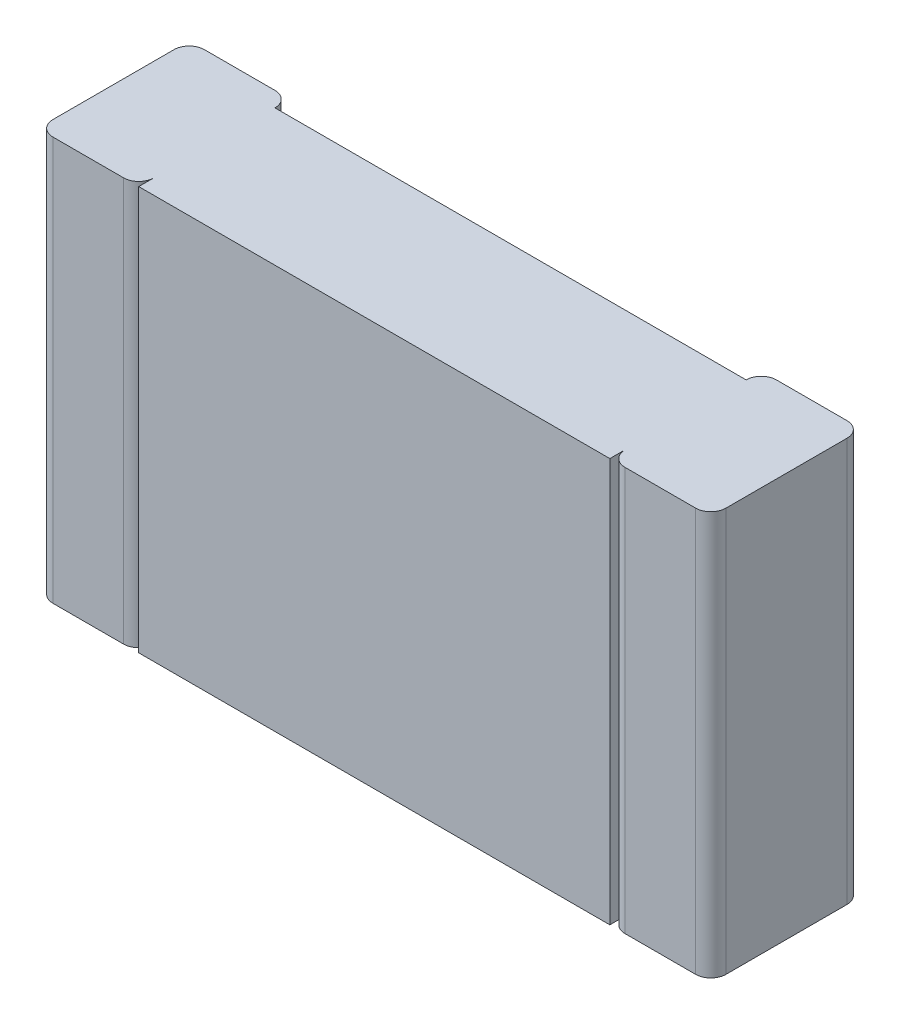
ISO-10303-21;
HEADER;
FILE_DESCRIPTION(('STEP AP214'),'2;1');
FILE_NAME('part.step','',(''),(''),'','','');
FILE_SCHEMA(('AUTOMOTIVE_DESIGN { 1 0 10303 214 1 1 1 1 }'));
ENDSEC;
DATA;
#1=APPLICATION_CONTEXT('core data for automotive mechanical design processes');
#2=APPLICATION_PROTOCOL_DEFINITION('international standard','automotive_design',2000,#1);
#3=PRODUCT_CONTEXT('',#1,'mechanical');
#4=PRODUCT('Part','Part','',(#3));
#5=PRODUCT_RELATED_PRODUCT_CATEGORY('part','',(#4));
#6=PRODUCT_DEFINITION_FORMATION('','',#4);
#7=PRODUCT_DEFINITION_CONTEXT('part definition',#1,'design');
#8=PRODUCT_DEFINITION('design','',#6,#7);
#9=PRODUCT_DEFINITION_SHAPE('','',#8);
#10=(LENGTH_UNIT() NAMED_UNIT(*) SI_UNIT(.MILLI.,.METRE.));
#11=(NAMED_UNIT(*) PLANE_ANGLE_UNIT() SI_UNIT($,.RADIAN.));
#12=(NAMED_UNIT(*) SI_UNIT($,.STERADIAN.) SOLID_ANGLE_UNIT());
#13=UNCERTAINTY_MEASURE_WITH_UNIT(LENGTH_MEASURE(1.E-05),#10,'distance_accuracy_value','');
#14=(GEOMETRIC_REPRESENTATION_CONTEXT(3) GLOBAL_UNCERTAINTY_ASSIGNED_CONTEXT((#13)) GLOBAL_UNIT_ASSIGNED_CONTEXT((#10,
#11,#12)) REPRESENTATION_CONTEXT('',''));
#15=CARTESIAN_POINT('',(0.,0.,0.));
#16=DIRECTION('',(0.,0.,1.));
#17=DIRECTION('',(1.,0.,0.));
#18=AXIS2_PLACEMENT_3D('',#15,#16,#17);
#19=CARTESIAN_POINT('',(-0.955,-0.6,0.045));
#20=DIRECTION('',(0.,1.,0.));
#21=DIRECTION('',(0.,0.,1.));
#22=AXIS2_PLACEMENT_3D('',#19,#20,#21);
#23=CYLINDRICAL_SURFACE('',#22,0.045);
#24=DIRECTION('',(0.,1.,0.));
#25=VECTOR('',#24,1.);
#26=CARTESIAN_POINT('',(-0.955,-0.6,0.));
#27=LINE('',#26,#25);
#28=CARTESIAN_POINT('',(-0.955,0.6,0.));
#29=VERTEX_POINT('',#28);
#30=CARTESIAN_POINT('',(-0.955,-0.6,0.));
#31=VERTEX_POINT('',#30);
#32=EDGE_CURVE('E129',#29,#31,#27,.F.);
#33=ORIENTED_EDGE('',*,*,#32,.T.);
#34=CARTESIAN_POINT('',(-0.955,-0.6,0.045));
#35=DIRECTION('',(0.,1.,0.));
#36=DIRECTION('',(0.,0.,1.));
#37=AXIS2_PLACEMENT_3D('',#34,#35,#36);
#38=CIRCLE('',#37,0.045);
#39=CARTESIAN_POINT('',(-1.,-0.6,0.045));
#40=VERTEX_POINT('',#39);
#41=EDGE_CURVE('E20',#31,#40,#38,.T.);
#42=ORIENTED_EDGE('',*,*,#41,.T.);
#43=DIRECTION('',(0.,1.,0.));
#44=VECTOR('',#43,1.);
#45=CARTESIAN_POINT('',(-1.,-0.6,0.045));
#46=LINE('',#45,#44);
#47=CARTESIAN_POINT('',(-1.,0.6,0.045));
#48=VERTEX_POINT('',#47);
#49=EDGE_CURVE('E136',#40,#48,#46,.T.);
#50=ORIENTED_EDGE('',*,*,#49,.T.);
#51=CARTESIAN_POINT('',(-0.955,0.6,0.045));
#52=DIRECTION('',(0.,1.,0.));
#53=DIRECTION('',(0.,0.,1.));
#54=AXIS2_PLACEMENT_3D('',#51,#52,#53);
#55=CIRCLE('',#54,0.045);
#56=EDGE_CURVE('E232',#29,#48,#55,.T.);
#57=ORIENTED_EDGE('',*,*,#56,.F.);
#58=EDGE_LOOP('',(#33,#42,#50,#57));
#59=FACE_BOUND('',#58,.T.);
#60=ADVANCED_FACE('F17',(#59),#23,.T.);
#61=CARTESIAN_POINT('',(-1.,-0.6,0.));
#62=DIRECTION('',(1.,0.,0.));
#63=DIRECTION('',(0.,0.,-1.));
#64=AXIS2_PLACEMENT_3D('',#61,#62,#63);
#65=PLANE('',#64);
#66=DIRECTION('',(0.,0.,1.));
#67=VECTOR('',#66,1.);
#68=CARTESIAN_POINT('',(-1.,0.6,0.));
#69=LINE('',#68,#67);
#70=CARTESIAN_POINT('',(-1.,0.6,0.405));
#71=VERTEX_POINT('',#70);
#72=EDGE_CURVE('E141',#48,#71,#69,.T.);
#73=ORIENTED_EDGE('',*,*,#72,.F.);
#74=ORIENTED_EDGE('',*,*,#49,.F.);
#75=DIRECTION('',(0.,0.,1.));
#76=VECTOR('',#75,1.);
#77=CARTESIAN_POINT('',(-1.,-0.6,0.));
#78=LINE('',#77,#76);
#79=CARTESIAN_POINT('',(-1.,-0.6,0.405));
#80=VERTEX_POINT('',#79);
#81=EDGE_CURVE('E140',#40,#80,#78,.T.);
#82=ORIENTED_EDGE('',*,*,#81,.T.);
#83=DIRECTION('',(0.,1.,0.));
#84=VECTOR('',#83,1.);
#85=CARTESIAN_POINT('',(-1.,-0.6,0.405));
#86=LINE('',#85,#84);
#87=EDGE_CURVE('E142',#71,#80,#86,.F.);
#88=ORIENTED_EDGE('',*,*,#87,.F.);
#89=EDGE_LOOP('',(#73,#74,#82,#88));
#90=FACE_BOUND('',#89,.T.);
#91=ADVANCED_FACE('F138',(#90),#65,.F.);
#92=CARTESIAN_POINT('',(-0.955,-0.6,0.405));
#93=DIRECTION('',(0.,1.,0.));
#94=DIRECTION('',(0.,0.,1.));
#95=AXIS2_PLACEMENT_3D('',#92,#93,#94);
#96=CYLINDRICAL_SURFACE('',#95,0.045);
#97=CARTESIAN_POINT('',(-0.955,0.6,0.405));
#98=DIRECTION('',(0.,1.,0.));
#99=DIRECTION('',(0.,0.,1.));
#100=AXIS2_PLACEMENT_3D('',#97,#98,#99);
#101=CIRCLE('',#100,0.045);
#102=CARTESIAN_POINT('',(-0.955,0.6,0.45));
#103=VERTEX_POINT('',#102);
#104=EDGE_CURVE('E230',#71,#103,#101,.T.);
#105=ORIENTED_EDGE('',*,*,#104,.F.);
#106=ORIENTED_EDGE('',*,*,#87,.T.);
#107=CARTESIAN_POINT('',(-0.955,-0.6,0.405));
#108=DIRECTION('',(0.,1.,0.));
#109=DIRECTION('',(0.,0.,1.));
#110=AXIS2_PLACEMENT_3D('',#107,#108,#109);
#111=CIRCLE('',#110,0.045);
#112=CARTESIAN_POINT('',(-0.955,-0.6,0.45));
#113=VERTEX_POINT('',#112);
#114=EDGE_CURVE('E151',#80,#113,#111,.T.);
#115=ORIENTED_EDGE('',*,*,#114,.T.);
#116=DIRECTION('',(0.,1.,0.));
#117=VECTOR('',#116,1.);
#118=CARTESIAN_POINT('',(-0.955,-0.6,0.45));
#119=LINE('',#118,#117);
#120=EDGE_CURVE('E200',#103,#113,#119,.F.);
#121=ORIENTED_EDGE('',*,*,#120,.F.);
#122=EDGE_LOOP('',(#105,#106,#115,#121));
#123=FACE_BOUND('',#122,.T.);
#124=ADVANCED_FACE('F452',(#123),#96,.T.);
#125=CARTESIAN_POINT('',(-1.,-0.6,0.45));
#126=DIRECTION('',(0.,0.,1.));
#127=DIRECTION('',(1.,0.,0.));
#128=AXIS2_PLACEMENT_3D('',#125,#126,#127);
#129=PLANE('',#128);
#130=DIRECTION('',(1.,0.,0.));
#131=VECTOR('',#130,1.);
#132=CARTESIAN_POINT('',(-1.,-0.6,0.45));
#133=LINE('',#132,#131);
#134=CARTESIAN_POINT('',(-0.745,-0.6,0.45));
#135=VERTEX_POINT('',#134);
#136=EDGE_CURVE('E248',#113,#135,#133,.T.);
#137=ORIENTED_EDGE('',*,*,#136,.T.);
#138=DIRECTION('',(0.,1.,0.));
#139=VECTOR('',#138,1.);
#140=CARTESIAN_POINT('',(-0.745,-0.6,0.45));
#141=LINE('',#140,#139);
#142=CARTESIAN_POINT('',(-0.745,0.6,0.45));
#143=VERTEX_POINT('',#142);
#144=EDGE_CURVE('E198',#143,#135,#141,.F.);
#145=ORIENTED_EDGE('',*,*,#144,.F.);
#146=DIRECTION('',(1.,0.,0.));
#147=VECTOR('',#146,1.);
#148=CARTESIAN_POINT('',(-1.,0.6,0.45));
#149=LINE('',#148,#147);
#150=EDGE_CURVE('E229',#103,#143,#149,.T.);
#151=ORIENTED_EDGE('',*,*,#150,.F.);
#152=ORIENTED_EDGE('',*,*,#120,.T.);
#153=EDGE_LOOP('',(#137,#145,#151,#152));
#154=FACE_BOUND('',#153,.T.);
#155=ADVANCED_FACE('F442',(#154),#129,.T.);
#156=CARTESIAN_POINT('',(-0.745,-0.6,0.405));
#157=DIRECTION('',(0.,1.,0.));
#158=DIRECTION('',(0.,0.,1.));
#159=AXIS2_PLACEMENT_3D('',#156,#157,#158);
#160=CYLINDRICAL_SURFACE('',#159,0.045);
#161=ORIENTED_EDGE('',*,*,#144,.T.);
#162=CARTESIAN_POINT('',(-0.745,-0.6,0.405));
#163=DIRECTION('',(0.,1.,0.));
#164=DIRECTION('',(0.,0.,1.));
#165=AXIS2_PLACEMENT_3D('',#162,#163,#164);
#166=CIRCLE('',#165,0.045);
#167=CARTESIAN_POINT('',(-0.7,-0.6,0.405));
#168=VERTEX_POINT('',#167);
#169=EDGE_CURVE('E246',#135,#168,#166,.T.);
#170=ORIENTED_EDGE('',*,*,#169,.T.);
#171=DIRECTION('',(0.,1.,0.));
#172=VECTOR('',#171,1.);
#173=CARTESIAN_POINT('',(-0.7,-0.6,0.405));
#174=LINE('',#173,#172);
#175=CARTESIAN_POINT('',(-0.7,0.6,0.405));
#176=VERTEX_POINT('',#175);
#177=EDGE_CURVE('E193',#168,#176,#174,.T.);
#178=ORIENTED_EDGE('',*,*,#177,.T.);
#179=CARTESIAN_POINT('',(-0.745,0.6,0.405));
#180=DIRECTION('',(0.,1.,0.));
#181=DIRECTION('',(0.,0.,1.));
#182=AXIS2_PLACEMENT_3D('',#179,#180,#181);
#183=CIRCLE('',#182,0.045);
#184=EDGE_CURVE('E227',#143,#176,#183,.T.);
#185=ORIENTED_EDGE('',*,*,#184,.F.);
#186=EDGE_LOOP('',(#161,#170,#178,#185));
#187=FACE_BOUND('',#186,.T.);
#188=ADVANCED_FACE('F430',(#187),#160,.T.);
#189=CARTESIAN_POINT('',(-0.7,-0.6,0.405));
#190=DIRECTION('',(1.,0.,0.));
#191=DIRECTION('',(0.,0.,-1.));
#192=AXIS2_PLACEMENT_3D('',#189,#190,#191);
#193=PLANE('',#192);
#194=DIRECTION('',(0.,0.,1.));
#195=VECTOR('',#194,1.);
#196=CARTESIAN_POINT('',(-0.7,0.6,0.405));
#197=LINE('',#196,#195);
#198=CARTESIAN_POINT('',(-0.7,0.6,0.45));
#199=VERTEX_POINT('',#198);
#200=EDGE_CURVE('E188',#176,#199,#197,.T.);
#201=ORIENTED_EDGE('',*,*,#200,.F.);
#202=ORIENTED_EDGE('',*,*,#177,.F.);
#203=DIRECTION('',(0.,0.,1.));
#204=VECTOR('',#203,1.);
#205=CARTESIAN_POINT('',(-0.7,-0.6,0.405));
#206=LINE('',#205,#204);
#207=CARTESIAN_POINT('',(-0.7,-0.6,0.45));
#208=VERTEX_POINT('',#207);
#209=EDGE_CURVE('E206',#168,#208,#206,.T.);
#210=ORIENTED_EDGE('',*,*,#209,.T.);
#211=DIRECTION('',(0.,1.,0.));
#212=VECTOR('',#211,1.);
#213=CARTESIAN_POINT('',(-0.7,-0.6,0.45));
#214=LINE('',#213,#212);
#215=EDGE_CURVE('E181',#199,#208,#214,.F.);
#216=ORIENTED_EDGE('',*,*,#215,.F.);
#217=EDGE_LOOP('',(#201,#202,#210,#216));
#218=FACE_BOUND('',#217,.T.);
#219=ADVANCED_FACE('F420',(#218),#193,.F.);
#220=CARTESIAN_POINT('',(-0.7,-0.6,0.45));
#221=DIRECTION('',(0.,0.,1.));
#222=DIRECTION('',(1.,0.,0.));
#223=AXIS2_PLACEMENT_3D('',#220,#221,#222);
#224=PLANE('',#223);
#225=DIRECTION('',(0.,1.,0.));
#226=VECTOR('',#225,1.);
#227=CARTESIAN_POINT('',(0.7,-0.6,0.45));
#228=LINE('',#227,#226);
#229=CARTESIAN_POINT('',(0.7,0.6,0.45));
#230=VERTEX_POINT('',#229);
#231=CARTESIAN_POINT('',(0.7,-0.6,0.45));
#232=VERTEX_POINT('',#231);
#233=EDGE_CURVE('E174',#230,#232,#228,.F.);
#234=ORIENTED_EDGE('',*,*,#233,.F.);
#235=DIRECTION('',(1.,0.,0.));
#236=VECTOR('',#235,1.);
#237=CARTESIAN_POINT('',(-0.7,0.6,0.45));
#238=LINE('',#237,#236);
#239=EDGE_CURVE('E184',#199,#230,#238,.T.);
#240=ORIENTED_EDGE('',*,*,#239,.F.);
#241=ORIENTED_EDGE('',*,*,#215,.T.);
#242=DIRECTION('',(1.,0.,0.));
#243=VECTOR('',#242,1.);
#244=CARTESIAN_POINT('',(-0.7,-0.6,0.45));
#245=LINE('',#244,#243);
#246=EDGE_CURVE('E203',#208,#232,#245,.T.);
#247=ORIENTED_EDGE('',*,*,#246,.T.);
#248=EDGE_LOOP('',(#234,#240,#241,#247));
#249=FACE_BOUND('',#248,.T.);
#250=ADVANCED_FACE('F407',(#249),#224,.T.);
#251=CARTESIAN_POINT('',(0.7,-0.6,0.405));
#252=DIRECTION('',(1.,0.,0.));
#253=DIRECTION('',(0.,0.,-1.));
#254=AXIS2_PLACEMENT_3D('',#251,#252,#253);
#255=PLANE('',#254);
#256=DIRECTION('',(0.,0.,1.));
#257=VECTOR('',#256,1.);
#258=CARTESIAN_POINT('',(0.7,0.6,0.405));
#259=LINE('',#258,#257);
#260=CARTESIAN_POINT('',(0.7,0.6,0.405));
#261=VERTEX_POINT('',#260);
#262=EDGE_CURVE('E187',#230,#261,#259,.F.);
#263=ORIENTED_EDGE('',*,*,#262,.F.);
#264=ORIENTED_EDGE('',*,*,#233,.T.);
#265=DIRECTION('',(0.,0.,1.));
#266=VECTOR('',#265,1.);
#267=CARTESIAN_POINT('',(0.7,-0.6,0.405));
#268=LINE('',#267,#266);
#269=CARTESIAN_POINT('',(0.7,-0.6,0.405));
#270=VERTEX_POINT('',#269);
#271=EDGE_CURVE('E178',#232,#270,#268,.F.);
#272=ORIENTED_EDGE('',*,*,#271,.T.);
#273=DIRECTION('',(0.,1.,0.));
#274=VECTOR('',#273,1.);
#275=CARTESIAN_POINT('',(0.7,-0.6,0.405));
#276=LINE('',#275,#274);
#277=EDGE_CURVE('E172',#261,#270,#276,.F.);
#278=ORIENTED_EDGE('',*,*,#277,.F.);
#279=EDGE_LOOP('',(#263,#264,#272,#278));
#280=FACE_BOUND('',#279,.T.);
#281=ADVANCED_FACE('F375',(#280),#255,.T.);
#282=CARTESIAN_POINT('',(0.745,-0.6,0.405));
#283=DIRECTION('',(0.,1.,0.));
#284=DIRECTION('',(0.,0.,1.));
#285=AXIS2_PLACEMENT_3D('',#282,#283,#284);
#286=CYLINDRICAL_SURFACE('',#285,0.045);
#287=CARTESIAN_POINT('',(0.745,0.6,0.405));
#288=DIRECTION('',(0.,1.,0.));
#289=DIRECTION('',(0.,0.,1.));
#290=AXIS2_PLACEMENT_3D('',#287,#288,#289);
#291=CIRCLE('',#290,0.045);
#292=CARTESIAN_POINT('',(0.745,0.6,0.45));
#293=VERTEX_POINT('',#292);
#294=EDGE_CURVE('E224',#261,#293,#291,.T.);
#295=ORIENTED_EDGE('',*,*,#294,.F.);
#296=ORIENTED_EDGE('',*,*,#277,.T.);
#297=CARTESIAN_POINT('',(0.745,-0.6,0.405));
#298=DIRECTION('',(0.,1.,0.));
#299=DIRECTION('',(0.,0.,1.));
#300=AXIS2_PLACEMENT_3D('',#297,#298,#299);
#301=CIRCLE('',#300,0.045);
#302=CARTESIAN_POINT('',(0.745,-0.6,0.45));
#303=VERTEX_POINT('',#302);
#304=EDGE_CURVE('E243',#270,#303,#301,.T.);
#305=ORIENTED_EDGE('',*,*,#304,.T.);
#306=DIRECTION('',(0.,1.,0.));
#307=VECTOR('',#306,1.);
#308=CARTESIAN_POINT('',(0.745,-0.6,0.45));
#309=LINE('',#308,#307);
#310=EDGE_CURVE('E170',#293,#303,#309,.F.);
#311=ORIENTED_EDGE('',*,*,#310,.F.);
#312=EDGE_LOOP('',(#295,#296,#305,#311));
#313=FACE_BOUND('',#312,.T.);
#314=ADVANCED_FACE('F406',(#313),#286,.T.);
#315=CARTESIAN_POINT('',(0.7,-0.6,0.45));
#316=DIRECTION('',(0.,0.,1.));
#317=DIRECTION('',(1.,0.,0.));
#318=AXIS2_PLACEMENT_3D('',#315,#316,#317);
#319=PLANE('',#318);
#320=DIRECTION('',(1.,0.,0.));
#321=VECTOR('',#320,1.);
#322=CARTESIAN_POINT('',(0.7,-0.6,0.45));
#323=LINE('',#322,#321);
#324=CARTESIAN_POINT('',(0.955,-0.6,0.45));
#325=VERTEX_POINT('',#324);
#326=EDGE_CURVE('E242',#303,#325,#323,.T.);
#327=ORIENTED_EDGE('',*,*,#326,.T.);
#328=DIRECTION('',(0.,1.,0.));
#329=VECTOR('',#328,1.);
#330=CARTESIAN_POINT('',(0.955,-0.6,0.45));
#331=LINE('',#330,#329);
#332=CARTESIAN_POINT('',(0.955,0.6,0.45));
#333=VERTEX_POINT('',#332);
#334=EDGE_CURVE('E168',#333,#325,#331,.F.);
#335=ORIENTED_EDGE('',*,*,#334,.F.);
#336=DIRECTION('',(1.,0.,0.));
#337=VECTOR('',#336,1.);
#338=CARTESIAN_POINT('',(0.7,0.6,0.45));
#339=LINE('',#338,#337);
#340=EDGE_CURVE('E223',#293,#333,#339,.T.);
#341=ORIENTED_EDGE('',*,*,#340,.F.);
#342=ORIENTED_EDGE('',*,*,#310,.T.);
#343=EDGE_LOOP('',(#327,#335,#341,#342));
#344=FACE_BOUND('',#343,.T.);
#345=ADVANCED_FACE('F483',(#344),#319,.T.);
#346=CARTESIAN_POINT('',(0.955,-0.6,0.405));
#347=DIRECTION('',(0.,1.,0.));
#348=DIRECTION('',(0.,0.,1.));
#349=AXIS2_PLACEMENT_3D('',#346,#347,#348);
#350=CYLINDRICAL_SURFACE('',#349,0.045);
#351=ORIENTED_EDGE('',*,*,#334,.T.);
#352=CARTESIAN_POINT('',(0.955,-0.6,0.405));
#353=DIRECTION('',(0.,1.,0.));
#354=DIRECTION('',(0.,0.,1.));
#355=AXIS2_PLACEMENT_3D('',#352,#353,#354);
#356=CIRCLE('',#355,0.045);
#357=CARTESIAN_POINT('',(1.,-0.6,0.405));
#358=VERTEX_POINT('',#357);
#359=EDGE_CURVE('E239',#325,#358,#356,.T.);
#360=ORIENTED_EDGE('',*,*,#359,.T.);
#361=DIRECTION('',(0.,1.,0.));
#362=VECTOR('',#361,1.);
#363=CARTESIAN_POINT('',(1.,-0.6,0.405));
#364=LINE('',#363,#362);
#365=CARTESIAN_POINT('',(1.,0.6,0.405));
#366=VERTEX_POINT('',#365);
#367=EDGE_CURVE('E166',#366,#358,#364,.F.);
#368=ORIENTED_EDGE('',*,*,#367,.F.);
#369=CARTESIAN_POINT('',(0.955,0.6,0.405));
#370=DIRECTION('',(0.,1.,0.));
#371=DIRECTION('',(0.,0.,1.));
#372=AXIS2_PLACEMENT_3D('',#369,#370,#371);
#373=CIRCLE('',#372,0.045);
#374=EDGE_CURVE('E221',#333,#366,#373,.T.);
#375=ORIENTED_EDGE('',*,*,#374,.F.);
#376=EDGE_LOOP('',(#351,#360,#368,#375));
#377=FACE_BOUND('',#376,.T.);
#378=ADVANCED_FACE('F487',(#377),#350,.T.);
#379=CARTESIAN_POINT('',(1.,-0.6,0.));
#380=DIRECTION('',(1.,0.,0.));
#381=DIRECTION('',(0.,0.,-1.));
#382=AXIS2_PLACEMENT_3D('',#379,#380,#381);
#383=PLANE('',#382);
#384=DIRECTION('',(0.,0.,1.));
#385=VECTOR('',#384,1.);
#386=CARTESIAN_POINT('',(1.,0.6,0.));
#387=LINE('',#386,#385);
#388=CARTESIAN_POINT('',(1.,0.6,0.045));
#389=VERTEX_POINT('',#388);
#390=EDGE_CURVE('E220',#366,#389,#387,.F.);
#391=ORIENTED_EDGE('',*,*,#390,.F.);
#392=ORIENTED_EDGE('',*,*,#367,.T.);
#393=DIRECTION('',(0.,0.,1.));
#394=VECTOR('',#393,1.);
#395=CARTESIAN_POINT('',(1.,-0.6,0.));
#396=LINE('',#395,#394);
#397=CARTESIAN_POINT('',(1.,-0.6,0.045));
#398=VERTEX_POINT('',#397);
#399=EDGE_CURVE('E238',#358,#398,#396,.F.);
#400=ORIENTED_EDGE('',*,*,#399,.T.);
#401=DIRECTION('',(0.,1.,0.));
#402=VECTOR('',#401,1.);
#403=CARTESIAN_POINT('',(1.,-0.6,0.045));
#404=LINE('',#403,#402);
#405=EDGE_CURVE('E157',#389,#398,#404,.F.);
#406=ORIENTED_EDGE('',*,*,#405,.F.);
#407=EDGE_LOOP('',(#391,#392,#400,#406));
#408=FACE_BOUND('',#407,.T.);
#409=ADVANCED_FACE('F298',(#408),#383,.T.);
#410=CARTESIAN_POINT('',(0.955,-0.6,0.045));
#411=DIRECTION('',(0.,1.,0.));
#412=DIRECTION('',(0.,0.,1.));
#413=AXIS2_PLACEMENT_3D('',#410,#411,#412);
#414=CYLINDRICAL_SURFACE('',#413,0.045);
#415=CARTESIAN_POINT('',(0.955,0.6,0.045));
#416=DIRECTION('',(0.,1.,0.));
#417=DIRECTION('',(0.,0.,1.));
#418=AXIS2_PLACEMENT_3D('',#415,#416,#417);
#419=CIRCLE('',#418,0.045);
#420=CARTESIAN_POINT('',(0.955,0.6,0.));
#421=VERTEX_POINT('',#420);
#422=EDGE_CURVE('E217',#389,#421,#419,.T.);
#423=ORIENTED_EDGE('',*,*,#422,.F.);
#424=ORIENTED_EDGE('',*,*,#405,.T.);
#425=CARTESIAN_POINT('',(0.955,-0.6,0.045));
#426=DIRECTION('',(0.,1.,0.));
#427=DIRECTION('',(0.,0.,1.));
#428=AXIS2_PLACEMENT_3D('',#425,#426,#427);
#429=CIRCLE('',#428,0.045);
#430=CARTESIAN_POINT('',(0.955,-0.6,0.));
#431=VERTEX_POINT('',#430);
#432=EDGE_CURVE('E235',#398,#431,#429,.T.);
#433=ORIENTED_EDGE('',*,*,#432,.T.);
#434=DIRECTION('',(0.,1.,0.));
#435=VECTOR('',#434,1.);
#436=CARTESIAN_POINT('',(0.955,-0.6,0.));
#437=LINE('',#436,#435);
#438=EDGE_CURVE('E175',#431,#421,#437,.T.);
#439=ORIENTED_EDGE('',*,*,#438,.T.);
#440=EDGE_LOOP('',(#423,#424,#433,#439));
#441=FACE_BOUND('',#440,.T.);
#442=ADVANCED_FACE('F302',(#441),#414,.T.);
#443=CARTESIAN_POINT('',(-1.,-0.6,0.));
#444=DIRECTION('',(0.,0.,1.));
#445=DIRECTION('',(1.,0.,0.));
#446=AXIS2_PLACEMENT_3D('',#443,#444,#445);
#447=PLANE('',#446);
#448=DIRECTION('',(1.,0.,0.));
#449=VECTOR('',#448,1.);
#450=CARTESIAN_POINT('',(-1.,-0.6,0.));
#451=LINE('',#450,#449);
#452=CARTESIAN_POINT('',(-0.745,-0.6,0.));
#453=VERTEX_POINT('',#452);
#454=EDGE_CURVE('E153',#453,#31,#451,.F.);
#455=ORIENTED_EDGE('',*,*,#454,.T.);
#456=ORIENTED_EDGE('',*,*,#32,.F.);
#457=DIRECTION('',(1.,0.,0.));
#458=VECTOR('',#457,1.);
#459=CARTESIAN_POINT('',(-1.,0.6,0.));
#460=LINE('',#459,#458);
#461=CARTESIAN_POINT('',(-0.745,0.6,0.));
#462=VERTEX_POINT('',#461);
#463=EDGE_CURVE('E234',#462,#29,#460,.F.);
#464=ORIENTED_EDGE('',*,*,#463,.F.);
#465=DIRECTION('',(0.,1.,0.));
#466=VECTOR('',#465,1.);
#467=CARTESIAN_POINT('',(-0.745,-0.6,0.));
#468=LINE('',#467,#466);
#469=EDGE_CURVE('E161',#453,#462,#468,.T.);
#470=ORIENTED_EDGE('',*,*,#469,.F.);
#471=EDGE_LOOP('',(#455,#456,#464,#470));
#472=FACE_BOUND('',#471,.T.);
#473=ADVANCED_FACE('F319',(#472),#447,.F.);
#474=CARTESIAN_POINT('',(0.7,-0.6,0.));
#475=DIRECTION('',(0.,0.,1.));
#476=DIRECTION('',(1.,0.,0.));
#477=AXIS2_PLACEMENT_3D('',#474,#475,#476);
#478=PLANE('',#477);
#479=DIRECTION('',(1.,0.,0.));
#480=VECTOR('',#479,1.);
#481=CARTESIAN_POINT('',(0.7,-0.6,0.));
#482=LINE('',#481,#480);
#483=CARTESIAN_POINT('',(0.745,-0.6,0.));
#484=VERTEX_POINT('',#483);
#485=EDGE_CURVE('E177',#431,#484,#482,.F.);
#486=ORIENTED_EDGE('',*,*,#485,.T.);
#487=DIRECTION('',(0.,1.,0.));
#488=VECTOR('',#487,1.);
#489=CARTESIAN_POINT('',(0.745,-0.6,0.));
#490=LINE('',#489,#488);
#491=CARTESIAN_POINT('',(0.745,0.6,0.));
#492=VERTEX_POINT('',#491);
#493=EDGE_CURVE('E212',#492,#484,#490,.F.);
#494=ORIENTED_EDGE('',*,*,#493,.F.);
#495=DIRECTION('',(1.,0.,0.));
#496=VECTOR('',#495,1.);
#497=CARTESIAN_POINT('',(0.7,0.6,0.));
#498=LINE('',#497,#496);
#499=EDGE_CURVE('E226',#421,#492,#498,.F.);
#500=ORIENTED_EDGE('',*,*,#499,.F.);
#501=ORIENTED_EDGE('',*,*,#438,.F.);
#502=EDGE_LOOP('',(#486,#494,#500,#501));
#503=FACE_BOUND('',#502,.T.);
#504=ADVANCED_FACE('F305',(#503),#478,.F.);
#505=CARTESIAN_POINT('',(-0.745,-0.6,0.045));
#506=DIRECTION('',(0.,1.,0.));
#507=DIRECTION('',(0.,0.,1.));
#508=AXIS2_PLACEMENT_3D('',#505,#506,#507);
#509=CYLINDRICAL_SURFACE('',#508,0.045);
#510=CARTESIAN_POINT('',(-0.745,0.6,0.045));
#511=DIRECTION('',(0.,1.,0.));
#512=DIRECTION('',(0.,0.,1.));
#513=AXIS2_PLACEMENT_3D('',#510,#511,#512);
#514=CIRCLE('',#513,0.045);
#515=CARTESIAN_POINT('',(-0.7,0.6,0.045));
#516=VERTEX_POINT('',#515);
#517=EDGE_CURVE('E163',#462,#516,#514,.F.);
#518=ORIENTED_EDGE('',*,*,#517,.T.);
#519=DIRECTION('',(0.,1.,0.));
#520=VECTOR('',#519,1.);
#521=CARTESIAN_POINT('',(-0.7,-0.6,0.045));
#522=LINE('',#521,#520);
#523=CARTESIAN_POINT('',(-0.7,-0.6,0.045));
#524=VERTEX_POINT('',#523);
#525=EDGE_CURVE('E211',#516,#524,#522,.F.);
#526=ORIENTED_EDGE('',*,*,#525,.T.);
#527=CARTESIAN_POINT('',(-0.745,-0.6,0.045));
#528=DIRECTION('',(0.,1.,0.));
#529=DIRECTION('',(0.,0.,1.));
#530=AXIS2_PLACEMENT_3D('',#527,#528,#529);
#531=CIRCLE('',#530,0.045);
#532=EDGE_CURVE('E164',#524,#453,#531,.T.);
#533=ORIENTED_EDGE('',*,*,#532,.T.);
#534=ORIENTED_EDGE('',*,*,#469,.T.);
#535=EDGE_LOOP('',(#518,#526,#533,#534));
#536=FACE_BOUND('',#535,.T.);
#537=ADVANCED_FACE('F318',(#536),#509,.T.);
#538=CARTESIAN_POINT('',(-0.955,-0.6,0.045));
#539=DIRECTION('',(0.,1.,0.));
#540=DIRECTION('',(0.,0.,1.));
#541=AXIS2_PLACEMENT_3D('',#538,#539,#540);
#542=PLANE('',#541);
#543=DIRECTION('',(1.,0.,0.));
#544=VECTOR('',#543,1.);
#545=CARTESIAN_POINT('',(-0.955,-0.6,0.045));
#546=LINE('',#545,#544);
#547=CARTESIAN_POINT('',(0.7,-0.6,0.045));
#548=VERTEX_POINT('',#547);
#549=EDGE_CURVE('E263',#524,#548,#546,.T.);
#550=ORIENTED_EDGE('',*,*,#549,.T.);
#551=CARTESIAN_POINT('',(0.745,-0.6,0.045));
#552=DIRECTION('',(0.,1.,0.));
#553=DIRECTION('',(0.,0.,1.));
#554=AXIS2_PLACEMENT_3D('',#551,#552,#553);
#555=CIRCLE('',#554,0.045);
#556=EDGE_CURVE('E209',#484,#548,#555,.T.);
#557=ORIENTED_EDGE('',*,*,#556,.F.);
#558=ORIENTED_EDGE('',*,*,#485,.F.);
#559=ORIENTED_EDGE('',*,*,#432,.F.);
#560=ORIENTED_EDGE('',*,*,#399,.F.);
#561=ORIENTED_EDGE('',*,*,#359,.F.);
#562=ORIENTED_EDGE('',*,*,#326,.F.);
#563=ORIENTED_EDGE('',*,*,#304,.F.);
#564=ORIENTED_EDGE('',*,*,#271,.F.);
#565=ORIENTED_EDGE('',*,*,#246,.F.);
#566=ORIENTED_EDGE('',*,*,#209,.F.);
#567=ORIENTED_EDGE('',*,*,#169,.F.);
#568=ORIENTED_EDGE('',*,*,#136,.F.);
#569=ORIENTED_EDGE('',*,*,#114,.F.);
#570=ORIENTED_EDGE('',*,*,#81,.F.);
#571=ORIENTED_EDGE('',*,*,#41,.F.);
#572=ORIENTED_EDGE('',*,*,#454,.F.);
#573=ORIENTED_EDGE('',*,*,#532,.F.);
#574=EDGE_LOOP('',(#550,#557,#558,#559,#560,#561,#562,#563,#564,#565,#566,#567,#568,#569,#570,
#571,#572,#573));
#575=FACE_BOUND('',#574,.T.);
#576=ADVANCED_FACE('F147',(#575),#542,.F.);
#577=CARTESIAN_POINT('',(0.745,-0.6,0.045));
#578=DIRECTION('',(0.,1.,0.));
#579=DIRECTION('',(0.,0.,1.));
#580=AXIS2_PLACEMENT_3D('',#577,#578,#579);
#581=CYLINDRICAL_SURFACE('',#580,0.045);
#582=ORIENTED_EDGE('',*,*,#493,.T.);
#583=ORIENTED_EDGE('',*,*,#556,.T.);
#584=DIRECTION('',(0.,1.,0.));
#585=VECTOR('',#584,1.);
#586=CARTESIAN_POINT('',(0.7,-0.6,0.045));
#587=LINE('',#586,#585);
#588=CARTESIAN_POINT('',(0.7,0.6,0.045));
#589=VERTEX_POINT('',#588);
#590=EDGE_CURVE('E26',#548,#589,#587,.T.);
#591=ORIENTED_EDGE('',*,*,#590,.T.);
#592=CARTESIAN_POINT('',(0.745,0.6,0.045));
#593=DIRECTION('',(0.,1.,0.));
#594=DIRECTION('',(0.,0.,1.));
#595=AXIS2_PLACEMENT_3D('',#592,#593,#594);
#596=CIRCLE('',#595,0.045);
#597=EDGE_CURVE('E34',#589,#492,#596,.F.);
#598=ORIENTED_EDGE('',*,*,#597,.T.);
#599=EDGE_LOOP('',(#582,#583,#591,#598));
#600=FACE_BOUND('',#599,.T.);
#601=ADVANCED_FACE('F311',(#600),#581,.T.);
#602=CARTESIAN_POINT('',(-0.955,0.6,0.045));
#603=DIRECTION('',(0.,1.,0.));
#604=DIRECTION('',(0.,0.,1.));
#605=AXIS2_PLACEMENT_3D('',#602,#603,#604);
#606=PLANE('',#605);
#607=DIRECTION('',(1.,0.,0.));
#608=VECTOR('',#607,1.);
#609=CARTESIAN_POINT('',(-0.955,0.6,0.045));
#610=LINE('',#609,#608);
#611=EDGE_CURVE('E11',#589,#516,#610,.F.);
#612=ORIENTED_EDGE('',*,*,#611,.T.);
#613=ORIENTED_EDGE('',*,*,#517,.F.);
#614=ORIENTED_EDGE('',*,*,#463,.T.);
#615=ORIENTED_EDGE('',*,*,#56,.T.);
#616=ORIENTED_EDGE('',*,*,#72,.T.);
#617=ORIENTED_EDGE('',*,*,#104,.T.);
#618=ORIENTED_EDGE('',*,*,#150,.T.);
#619=ORIENTED_EDGE('',*,*,#184,.T.);
#620=ORIENTED_EDGE('',*,*,#200,.T.);
#621=ORIENTED_EDGE('',*,*,#239,.T.);
#622=ORIENTED_EDGE('',*,*,#262,.T.);
#623=ORIENTED_EDGE('',*,*,#294,.T.);
#624=ORIENTED_EDGE('',*,*,#340,.T.);
#625=ORIENTED_EDGE('',*,*,#374,.T.);
#626=ORIENTED_EDGE('',*,*,#390,.T.);
#627=ORIENTED_EDGE('',*,*,#422,.T.);
#628=ORIENTED_EDGE('',*,*,#499,.T.);
#629=ORIENTED_EDGE('',*,*,#597,.F.);
#630=EDGE_LOOP('',(#612,#613,#614,#615,#616,#617,#618,#619,#620,#621,#622,#623,#624,#625,#626,
#627,#628,#629));
#631=FACE_BOUND('',#630,.T.);
#632=ADVANCED_FACE('F292',(#631),#606,.T.);
#633=CARTESIAN_POINT('',(-0.955,-0.6,0.045));
#634=DIRECTION('',(0.,0.,1.));
#635=DIRECTION('',(1.,0.,0.));
#636=AXIS2_PLACEMENT_3D('',#633,#634,#635);
#637=PLANE('',#636);
#638=ORIENTED_EDGE('',*,*,#590,.F.);
#639=ORIENTED_EDGE('',*,*,#549,.F.);
#640=ORIENTED_EDGE('',*,*,#525,.F.);
#641=ORIENTED_EDGE('',*,*,#611,.F.);
#642=EDGE_LOOP('',(#638,#639,#640,#641));
#643=FACE_BOUND('',#642,.T.);
#644=ADVANCED_FACE('F313',(#643),#637,.F.);
#645=CLOSED_SHELL('',(#60,#91,#124,#155,#188,#219,#250,#281,#314,#345,#378,#409,#442,#473,#504,
#537,#576,#601,#632,#644));
#646=MANIFOLD_SOLID_BREP('B1',#645);
#647=ADVANCED_BREP_SHAPE_REPRESENTATION('',(#18,#646),#14);
#648=SHAPE_DEFINITION_REPRESENTATION(#9,#647);
ENDSEC;
END-ISO-10303-21;
